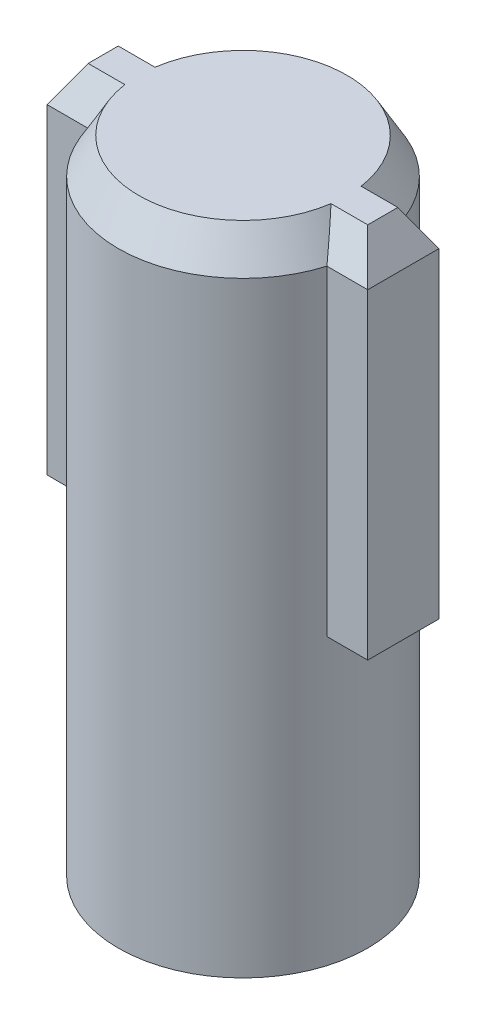
ISO-10303-21;
HEADER;
FILE_DESCRIPTION(('STEP AP214'),'2;1');
FILE_NAME('part.step','',(''),(''),'','','');
FILE_SCHEMA(('AUTOMOTIVE_DESIGN { 1 0 10303 214 1 1 1 1 }'));
ENDSEC;
DATA;
#1=APPLICATION_CONTEXT('core data for automotive mechanical design processes');
#2=APPLICATION_PROTOCOL_DEFINITION('international standard','automotive_design',2000,#1);
#3=PRODUCT_CONTEXT('',#1,'mechanical');
#4=PRODUCT('Part','Part','',(#3));
#5=PRODUCT_RELATED_PRODUCT_CATEGORY('part','',(#4));
#6=PRODUCT_DEFINITION_FORMATION('','',#4);
#7=PRODUCT_DEFINITION_CONTEXT('part definition',#1,'design');
#8=PRODUCT_DEFINITION('design','',#6,#7);
#9=PRODUCT_DEFINITION_SHAPE('','',#8);
#10=(LENGTH_UNIT() NAMED_UNIT(*) SI_UNIT(.MILLI.,.METRE.));
#11=(NAMED_UNIT(*) PLANE_ANGLE_UNIT() SI_UNIT($,.RADIAN.));
#12=(NAMED_UNIT(*) SI_UNIT($,.STERADIAN.) SOLID_ANGLE_UNIT());
#13=UNCERTAINTY_MEASURE_WITH_UNIT(LENGTH_MEASURE(1.E-05),#10,'distance_accuracy_value','');
#14=(GEOMETRIC_REPRESENTATION_CONTEXT(3) GLOBAL_UNCERTAINTY_ASSIGNED_CONTEXT((#13)) GLOBAL_UNIT_ASSIGNED_CONTEXT((#10,
#11,#12)) REPRESENTATION_CONTEXT('',''));
#15=CARTESIAN_POINT('',(0.,0.,0.));
#16=DIRECTION('',(0.,0.,1.));
#17=DIRECTION('',(1.,0.,0.));
#18=AXIS2_PLACEMENT_3D('',#15,#16,#17);
#19=CARTESIAN_POINT('',(0.,18.,0.));
#20=DIRECTION('',(0.,-1.,0.));
#21=DIRECTION('',(0.,0.,-1.));
#22=AXIS2_PLACEMENT_3D('',#19,#20,#21);
#23=CYLINDRICAL_SURFACE('',#22,3.5);
#24=DIRECTION('',(0.,-1.,0.));
#25=VECTOR('',#24,1.);
#26=CARTESIAN_POINT('',(-3.35410196624968,18.,-1.));
#27=LINE('',#26,#25);
#28=CARTESIAN_POINT('',(-3.35410196624968,12.,-1.));
#29=VERTEX_POINT('',#28);
#30=CARTESIAN_POINT('',(-3.35410196624968,17.,-1.));
#31=VERTEX_POINT('',#30);
#32=EDGE_CURVE('E187',#29,#31,#27,.F.);
#33=ORIENTED_EDGE('',*,*,#32,.T.);
#34=CARTESIAN_POINT('',(0.,17.,0.));
#35=DIRECTION('',(0.,1.,0.));
#36=DIRECTION('',(0.,0.,1.));
#37=AXIS2_PLACEMENT_3D('',#34,#35,#36);
#38=CIRCLE('',#37,3.5);
#39=CARTESIAN_POINT('',(3.35410196624968,17.,-1.));
#40=VERTEX_POINT('',#39);
#41=EDGE_CURVE('E220',#31,#40,#38,.F.);
#42=ORIENTED_EDGE('',*,*,#41,.T.);
#43=DIRECTION('',(0.,-1.,0.));
#44=VECTOR('',#43,1.);
#45=CARTESIAN_POINT('',(3.35410196624968,18.,-1.));
#46=LINE('',#45,#44);
#47=CARTESIAN_POINT('',(3.35410196624968,12.,-0.999999999999999));
#48=VERTEX_POINT('',#47);
#49=EDGE_CURVE('E190',#40,#48,#46,.T.);
#50=ORIENTED_EDGE('',*,*,#49,.T.);
#51=CARTESIAN_POINT('',(0.,12.,0.));
#52=DIRECTION('',(0.,-1.,0.));
#53=DIRECTION('',(0.,0.,-1.));
#54=AXIS2_PLACEMENT_3D('',#51,#52,#53);
#55=CIRCLE('',#54,3.5);
#56=EDGE_CURVE('E147',#29,#48,#55,.T.);
#57=ORIENTED_EDGE('',*,*,#56,.F.);
#58=EDGE_LOOP('',(#33,#42,#50,#57));
#59=FACE_BOUND('',#58,.T.);
#60=ADVANCED_FACE('F35',(#59),#23,.T.);
#61=DIRECTION('',(0.,-1.,0.));
#62=VECTOR('',#61,1.);
#63=CARTESIAN_POINT('',(3.35410196624968,18.,1.));
#64=LINE('',#63,#62);
#65=CARTESIAN_POINT('',(3.35410196624968,8.,1.));
#66=VERTEX_POINT('',#65);
#67=CARTESIAN_POINT('',(3.35410196624968,17.,1.));
#68=VERTEX_POINT('',#67);
#69=EDGE_CURVE('E181',#66,#68,#64,.F.);
#70=ORIENTED_EDGE('',*,*,#69,.T.);
#71=CARTESIAN_POINT('',(0.,17.,0.));
#72=DIRECTION('',(0.,1.,0.));
#73=DIRECTION('',(0.,0.,1.));
#74=AXIS2_PLACEMENT_3D('',#71,#72,#73);
#75=CIRCLE('',#74,3.5);
#76=CARTESIAN_POINT('',(-3.35410196624968,17.,1.));
#77=VERTEX_POINT('',#76);
#78=EDGE_CURVE('E11',#68,#77,#75,.F.);
#79=ORIENTED_EDGE('',*,*,#78,.T.);
#80=DIRECTION('',(0.,-1.,0.));
#81=VECTOR('',#80,1.);
#82=CARTESIAN_POINT('',(-3.35410196624968,18.,1.));
#83=LINE('',#82,#81);
#84=CARTESIAN_POINT('',(-3.35410196624968,8.,1.));
#85=VERTEX_POINT('',#84);
#86=EDGE_CURVE('E185',#77,#85,#83,.T.);
#87=ORIENTED_EDGE('',*,*,#86,.T.);
#88=CARTESIAN_POINT('',(0.,8.,0.));
#89=DIRECTION('',(0.,-1.,0.));
#90=DIRECTION('',(0.,0.,-1.));
#91=AXIS2_PLACEMENT_3D('',#88,#89,#90);
#92=CIRCLE('',#91,3.5);
#93=CARTESIAN_POINT('',(-3.35410196624968,8.,-1.));
#94=VERTEX_POINT('',#93);
#95=EDGE_CURVE('E144',#85,#94,#92,.T.);
#96=ORIENTED_EDGE('',*,*,#95,.T.);
#97=CARTESIAN_POINT('',(0.,8.,0.));
#98=DIRECTION('',(0.,-1.,0.));
#99=DIRECTION('',(0.,0.,-1.));
#100=AXIS2_PLACEMENT_3D('',#97,#98,#99);
#101=CIRCLE('',#100,3.5);
#102=CARTESIAN_POINT('',(3.35410196624968,8.,-0.999999999999999));
#103=VERTEX_POINT('',#102);
#104=EDGE_CURVE('E137',#94,#103,#101,.T.);
#105=ORIENTED_EDGE('',*,*,#104,.T.);
#106=EDGE_CURVE('E142',#103,#66,#92,.T.);
#107=ORIENTED_EDGE('',*,*,#106,.T.);
#108=EDGE_LOOP('',(#70,#79,#87,#96,#105,#107));
#109=FACE_BOUND('',#108,.T.);
#110=CARTESIAN_POINT('',(0.,0.,0.));
#111=DIRECTION('',(0.,1.,0.));
#112=DIRECTION('',(0.,0.,1.));
#113=AXIS2_PLACEMENT_3D('',#110,#111,#112);
#114=CIRCLE('',#113,3.5);
#115=CARTESIAN_POINT('',(0.,0.,3.5));
#116=VERTEX_POINT('',#115);
#117=EDGE_CURVE('E192',#116,#116,#114,.T.);
#118=ORIENTED_EDGE('',*,*,#117,.T.);
#119=EDGE_LOOP('',(#118));
#120=FACE_BOUND('',#119,.T.);
#121=ADVANCED_FACE('F139',(#109,#120),#23,.T.);
#122=CARTESIAN_POINT('',(0.,18.,0.));
#123=DIRECTION('',(0.,1.,0.));
#124=DIRECTION('',(0.,0.,1.));
#125=AXIS2_PLACEMENT_3D('',#122,#123,#124);
#126=PLANE('',#125);
#127=DIRECTION('',(0.,0.,1.));
#128=VECTOR('',#127,1.);
#129=CARTESIAN_POINT('',(-3.92264973081037,18.,0.));
#130=LINE('',#129,#128);
#131=CARTESIAN_POINT('',(-3.92264973081037,18.,-0.422649730810368));
#132=VERTEX_POINT('',#131);
#133=CARTESIAN_POINT('',(-3.92264973081037,18.,0.422649730810368));
#134=VERTEX_POINT('',#133);
#135=EDGE_CURVE('E206',#132,#134,#130,.T.);
#136=ORIENTED_EDGE('',*,*,#135,.T.);
#137=DIRECTION('',(1.,0.,0.));
#138=VECTOR('',#137,1.);
#139=CARTESIAN_POINT('',(0.,18.,0.422649730810368));
#140=LINE('',#139,#138);
#141=CARTESIAN_POINT('',(-2.891928189643,18.,0.422649730810362));
#142=VERTEX_POINT('',#141);
#143=EDGE_CURVE('E208',#134,#142,#140,.T.);
#144=ORIENTED_EDGE('',*,*,#143,.T.);
#145=CARTESIAN_POINT('',(0.,18.,0.));
#146=DIRECTION('',(0.,1.,0.));
#147=DIRECTION('',(0.,0.,1.));
#148=AXIS2_PLACEMENT_3D('',#145,#146,#147);
#149=CIRCLE('',#148,2.92264973081037);
#150=CARTESIAN_POINT('',(2.891928189643,18.,0.422649730810361));
#151=VERTEX_POINT('',#150);
#152=EDGE_CURVE('E163',#142,#151,#149,.T.);
#153=ORIENTED_EDGE('',*,*,#152,.T.);
#154=DIRECTION('',(1.,0.,0.));
#155=VECTOR('',#154,1.);
#156=CARTESIAN_POINT('',(0.,18.,0.422649730810368));
#157=LINE('',#156,#155);
#158=CARTESIAN_POINT('',(3.92264973081037,18.,0.422649730810367));
#159=VERTEX_POINT('',#158);
#160=EDGE_CURVE('E196',#151,#159,#157,.T.);
#161=ORIENTED_EDGE('',*,*,#160,.T.);
#162=DIRECTION('',(0.,0.,-1.));
#163=VECTOR('',#162,1.);
#164=CARTESIAN_POINT('',(3.92264973081037,18.,0.));
#165=LINE('',#164,#163);
#166=CARTESIAN_POINT('',(3.92264973081037,18.,-0.422649730810369));
#167=VERTEX_POINT('',#166);
#168=EDGE_CURVE('E198',#159,#167,#165,.T.);
#169=ORIENTED_EDGE('',*,*,#168,.T.);
#170=DIRECTION('',(-1.,0.,0.));
#171=VECTOR('',#170,1.);
#172=CARTESIAN_POINT('',(0.,18.,-0.422649730810368));
#173=LINE('',#172,#171);
#174=CARTESIAN_POINT('',(2.891928189643,18.,-0.422649730810369));
#175=VERTEX_POINT('',#174);
#176=EDGE_CURVE('E200',#167,#175,#173,.T.);
#177=ORIENTED_EDGE('',*,*,#176,.T.);
#178=CARTESIAN_POINT('',(0.,18.,0.));
#179=DIRECTION('',(0.,1.,0.));
#180=DIRECTION('',(0.,0.,1.));
#181=AXIS2_PLACEMENT_3D('',#178,#179,#180);
#182=CIRCLE('',#181,2.92264973081037);
#183=CARTESIAN_POINT('',(-2.891928189643,18.,-0.422649730810361));
#184=VERTEX_POINT('',#183);
#185=EDGE_CURVE('E202',#175,#184,#182,.T.);
#186=ORIENTED_EDGE('',*,*,#185,.T.);
#187=DIRECTION('',(-1.,0.,0.));
#188=VECTOR('',#187,1.);
#189=CARTESIAN_POINT('',(0.,18.,-0.422649730810368));
#190=LINE('',#189,#188);
#191=EDGE_CURVE('E204',#184,#132,#190,.T.);
#192=ORIENTED_EDGE('',*,*,#191,.T.);
#193=EDGE_LOOP('',(#136,#144,#153,#161,#169,#177,#186,#192));
#194=FACE_BOUND('',#193,.T.);
#195=ADVANCED_FACE('F285',(#194),#126,.T.);
#196=CARTESIAN_POINT('',(0.,0.,0.));
#197=DIRECTION('',(0.,1.,0.));
#198=DIRECTION('',(0.,0.,1.));
#199=AXIS2_PLACEMENT_3D('',#196,#197,#198);
#200=PLANE('',#199);
#201=ORIENTED_EDGE('',*,*,#117,.F.);
#202=EDGE_LOOP('',(#201));
#203=FACE_BOUND('',#202,.T.);
#204=ADVANCED_FACE('F287',(#203),#200,.F.);
#205=CARTESIAN_POINT('',(-4.5,8.,-1.));
#206=DIRECTION('',(-1.,0.,0.));
#207=DIRECTION('',(0.,0.,1.));
#208=AXIS2_PLACEMENT_3D('',#205,#206,#207);
#209=PLANE('',#208);
#210=DIRECTION('',(0.,1.,0.));
#211=VECTOR('',#210,1.);
#212=CARTESIAN_POINT('',(-4.5,8.,1.));
#213=LINE('',#212,#211);
#214=CARTESIAN_POINT('',(-4.5,8.,1.));
#215=VERTEX_POINT('',#214);
#216=CARTESIAN_POINT('',(-4.5,17.,1.));
#217=VERTEX_POINT('',#216);
#218=EDGE_CURVE('E169',#215,#217,#213,.T.);
#219=ORIENTED_EDGE('',*,*,#218,.T.);
#220=DIRECTION('',(0.,0.,-1.));
#221=VECTOR('',#220,1.);
#222=CARTESIAN_POINT('',(-4.5,17.,-1.));
#223=LINE('',#222,#221);
#224=CARTESIAN_POINT('',(-4.5,17.,-1.));
#225=VERTEX_POINT('',#224);
#226=EDGE_CURVE('E214',#217,#225,#223,.T.);
#227=ORIENTED_EDGE('',*,*,#226,.T.);
#228=DIRECTION('',(0.,1.,0.));
#229=VECTOR('',#228,1.);
#230=CARTESIAN_POINT('',(-4.5,8.,-1.));
#231=LINE('',#230,#229);
#232=CARTESIAN_POINT('',(-4.5,8.,-1.));
#233=VERTEX_POINT('',#232);
#234=EDGE_CURVE('E179',#233,#225,#231,.T.);
#235=ORIENTED_EDGE('',*,*,#234,.F.);
#236=DIRECTION('',(0.,0.,1.));
#237=VECTOR('',#236,1.);
#238=CARTESIAN_POINT('',(-4.5,8.,-1.));
#239=LINE('',#238,#237);
#240=EDGE_CURVE('E323',#233,#215,#239,.T.);
#241=ORIENTED_EDGE('',*,*,#240,.T.);
#242=EDGE_LOOP('',(#219,#227,#235,#241));
#243=FACE_BOUND('',#242,.T.);
#244=ADVANCED_FACE('F290',(#243),#209,.T.);
#245=CARTESIAN_POINT('',(0.,8.,0.));
#246=DIRECTION('',(0.,-1.,0.));
#247=DIRECTION('',(0.,0.,-1.));
#248=AXIS2_PLACEMENT_3D('',#245,#246,#247);
#249=PLANE('',#248);
#250=ORIENTED_EDGE('',*,*,#95,.F.);
#251=DIRECTION('',(1.,0.,0.));
#252=VECTOR('',#251,1.);
#253=CARTESIAN_POINT('',(4.5,8.,0.999999999999999));
#254=LINE('',#253,#252);
#255=EDGE_CURVE('E330',#215,#85,#254,.T.);
#256=ORIENTED_EDGE('',*,*,#255,.F.);
#257=ORIENTED_EDGE('',*,*,#240,.F.);
#258=DIRECTION('',(-1.,0.,0.));
#259=VECTOR('',#258,1.);
#260=CARTESIAN_POINT('',(4.5,8.,-1.));
#261=LINE('',#260,#259);
#262=EDGE_CURVE('E170',#94,#233,#261,.T.);
#263=ORIENTED_EDGE('',*,*,#262,.F.);
#264=EDGE_LOOP('',(#250,#256,#257,#263));
#265=FACE_BOUND('',#264,.T.);
#266=ADVANCED_FACE('F297',(#265),#249,.T.);
#267=CARTESIAN_POINT('',(4.5,8.,0.999999999999999));
#268=DIRECTION('',(0.,0.,1.));
#269=DIRECTION('',(1.,0.,0.));
#270=AXIS2_PLACEMENT_3D('',#267,#268,#269);
#271=PLANE('',#270);
#272=ORIENTED_EDGE('',*,*,#86,.F.);
#273=DIRECTION('',(-1.,0.,0.));
#274=VECTOR('',#273,1.);
#275=CARTESIAN_POINT('',(4.5,17.,0.999999999999999));
#276=LINE('',#275,#274);
#277=EDGE_CURVE('E211',#77,#217,#276,.T.);
#278=ORIENTED_EDGE('',*,*,#277,.T.);
#279=ORIENTED_EDGE('',*,*,#218,.F.);
#280=ORIENTED_EDGE('',*,*,#255,.T.);
#281=EDGE_LOOP('',(#272,#278,#279,#280));
#282=FACE_BOUND('',#281,.T.);
#283=ADVANCED_FACE('F299',(#282),#271,.T.);
#284=ORIENTED_EDGE('',*,*,#106,.F.);
#285=CARTESIAN_POINT('',(4.5,8.,-1.));
#286=VERTEX_POINT('',#285);
#287=EDGE_CURVE('E161',#286,#103,#261,.T.);
#288=ORIENTED_EDGE('',*,*,#287,.F.);
#289=DIRECTION('',(0.,0.,-1.));
#290=VECTOR('',#289,1.);
#291=CARTESIAN_POINT('',(4.5,8.,-1.));
#292=LINE('',#291,#290);
#293=CARTESIAN_POINT('',(4.5,8.,0.999999999999999));
#294=VERTEX_POINT('',#293);
#295=EDGE_CURVE('E175',#294,#286,#292,.T.);
#296=ORIENTED_EDGE('',*,*,#295,.F.);
#297=EDGE_CURVE('E162',#66,#294,#254,.T.);
#298=ORIENTED_EDGE('',*,*,#297,.F.);
#299=EDGE_LOOP('',(#284,#288,#296,#298));
#300=FACE_BOUND('',#299,.T.);
#301=ADVANCED_FACE('F159',(#300),#249,.T.);
#302=CARTESIAN_POINT('',(4.5,8.,-1.));
#303=DIRECTION('',(0.,0.,-1.));
#304=DIRECTION('',(-1.,0.,0.));
#305=AXIS2_PLACEMENT_3D('',#302,#303,#304);
#306=PLANE('',#305);
#307=ORIENTED_EDGE('',*,*,#234,.T.);
#308=DIRECTION('',(1.,0.,0.));
#309=VECTOR('',#308,1.);
#310=CARTESIAN_POINT('',(4.5,17.,-1.));
#311=LINE('',#310,#309);
#312=EDGE_CURVE('E218',#225,#31,#311,.T.);
#313=ORIENTED_EDGE('',*,*,#312,.T.);
#314=ORIENTED_EDGE('',*,*,#32,.F.);
#315=DIRECTION('',(-1.,0.,0.));
#316=VECTOR('',#315,1.);
#317=CARTESIAN_POINT('',(-5.,12.,-1.));
#318=LINE('',#317,#316);
#319=EDGE_CURVE('E148',#48,#29,#318,.T.);
#320=ORIENTED_EDGE('',*,*,#319,.F.);
#321=ORIENTED_EDGE('',*,*,#49,.F.);
#322=DIRECTION('',(1.,0.,0.));
#323=VECTOR('',#322,1.);
#324=CARTESIAN_POINT('',(4.5,17.,-1.));
#325=LINE('',#324,#323);
#326=CARTESIAN_POINT('',(4.5,17.,-1.));
#327=VERTEX_POINT('',#326);
#328=EDGE_CURVE('E216',#40,#327,#325,.T.);
#329=ORIENTED_EDGE('',*,*,#328,.T.);
#330=DIRECTION('',(0.,1.,0.));
#331=VECTOR('',#330,1.);
#332=CARTESIAN_POINT('',(4.5,8.,-1.));
#333=LINE('',#332,#331);
#334=EDGE_CURVE('E167',#286,#327,#333,.T.);
#335=ORIENTED_EDGE('',*,*,#334,.F.);
#336=ORIENTED_EDGE('',*,*,#287,.T.);
#337=DIRECTION('',(-1.,0.,0.));
#338=VECTOR('',#337,1.);
#339=CARTESIAN_POINT('',(-5.,8.,-1.));
#340=LINE('',#339,#338);
#341=EDGE_CURVE('E150',#103,#94,#340,.T.);
#342=ORIENTED_EDGE('',*,*,#341,.T.);
#343=ORIENTED_EDGE('',*,*,#262,.T.);
#344=EDGE_LOOP('',(#307,#313,#314,#320,#321,#329,#335,#336,#342,#343));
#345=FACE_BOUND('',#344,.T.);
#346=ADVANCED_FACE('F166',(#345),#306,.T.);
#347=DIRECTION('',(0.,1.,0.));
#348=VECTOR('',#347,1.);
#349=CARTESIAN_POINT('',(4.5,8.,0.999999999999999));
#350=LINE('',#349,#348);
#351=CARTESIAN_POINT('',(4.5,17.,0.999999999999999));
#352=VERTEX_POINT('',#351);
#353=EDGE_CURVE('E173',#294,#352,#350,.T.);
#354=ORIENTED_EDGE('',*,*,#353,.T.);
#355=DIRECTION('',(-1.,0.,0.));
#356=VECTOR('',#355,1.);
#357=CARTESIAN_POINT('',(4.5,17.,0.999999999999999));
#358=LINE('',#357,#356);
#359=EDGE_CURVE('E49',#352,#68,#358,.T.);
#360=ORIENTED_EDGE('',*,*,#359,.T.);
#361=ORIENTED_EDGE('',*,*,#69,.F.);
#362=ORIENTED_EDGE('',*,*,#297,.T.);
#363=EDGE_LOOP('',(#354,#360,#361,#362));
#364=FACE_BOUND('',#363,.T.);
#365=ADVANCED_FACE('F303',(#364),#271,.T.);
#366=CARTESIAN_POINT('',(4.5,8.,-1.));
#367=DIRECTION('',(1.,0.,0.));
#368=DIRECTION('',(0.,0.,-1.));
#369=AXIS2_PLACEMENT_3D('',#366,#367,#368);
#370=PLANE('',#369);
#371=ORIENTED_EDGE('',*,*,#334,.T.);
#372=DIRECTION('',(0.,0.,1.));
#373=VECTOR('',#372,1.);
#374=CARTESIAN_POINT('',(4.5,17.,-1.));
#375=LINE('',#374,#373);
#376=EDGE_CURVE('E64',#327,#352,#375,.T.);
#377=ORIENTED_EDGE('',*,*,#376,.T.);
#378=ORIENTED_EDGE('',*,*,#353,.F.);
#379=ORIENTED_EDGE('',*,*,#295,.T.);
#380=EDGE_LOOP('',(#371,#377,#378,#379));
#381=FACE_BOUND('',#380,.T.);
#382=ADVANCED_FACE('F304',(#381),#370,.T.);
#383=CARTESIAN_POINT('',(0.,12.,0.));
#384=DIRECTION('',(0.,-1.,0.));
#385=DIRECTION('',(0.,0.,-1.));
#386=AXIS2_PLACEMENT_3D('',#383,#384,#385);
#387=PLANE('',#386);
#388=ORIENTED_EDGE('',*,*,#56,.T.);
#389=ORIENTED_EDGE('',*,*,#319,.T.);
#390=EDGE_LOOP('',(#388,#389));
#391=FACE_BOUND('',#390,.T.);
#392=ADVANCED_FACE('F307',(#391),#387,.T.);
#393=CARTESIAN_POINT('',(0.,8.,0.));
#394=DIRECTION('',(0.,-1.,0.));
#395=DIRECTION('',(0.,0.,-1.));
#396=AXIS2_PLACEMENT_3D('',#393,#394,#395);
#397=PLANE('',#396);
#398=ORIENTED_EDGE('',*,*,#104,.F.);
#399=ORIENTED_EDGE('',*,*,#341,.F.);
#400=EDGE_LOOP('',(#398,#399));
#401=FACE_BOUND('',#400,.T.);
#402=ADVANCED_FACE('F151',(#401),#397,.F.);
#403=CARTESIAN_POINT('',(0.,18.,-0.422649730810368));
#404=DIRECTION('',(0.,-0.499999999999998,0.86602540378444));
#405=DIRECTION('',(-1.,0.,0.));
#406=AXIS2_PLACEMENT_3D('',#403,#404,#405);
#407=PLANE('',#406);
#408=DIRECTION('',(-0.447213595499956,0.774596669241485,0.447213595499957));
#409=VECTOR('',#408,1.);
#410=CARTESIAN_POINT('',(3.83811978464829,18.1464101615138,-0.338119784648296));
#411=LINE('',#410,#409);
#412=EDGE_CURVE('E264',#327,#167,#411,.T.);
#413=ORIENTED_EDGE('',*,*,#412,.F.);
#414=ORIENTED_EDGE('',*,*,#328,.F.);
#415=CARTESIAN_POINT('',(3.35410196624968,17.,-1.));
#416=CARTESIAN_POINT('',(3.31789876279821,17.0841225359634,-0.951431831216601));
#417=CARTESIAN_POINT('',(3.28118510315563,17.1680814693473,-0.902958118426541));
#418=CARTESIAN_POINT('',(3.20664393840968,17.3356117830366,-0.806234446720612));
#419=CARTESIAN_POINT('',(3.16881661552825,17.4191832241831,-0.757984452678081));
#420=CARTESIAN_POINT('',(3.09194204926259,17.5859087019816,-0.661725453190358));
#421=CARTESIAN_POINT('',(3.05289476073218,17.669062723054,-0.613716456740038));
#422=CARTESIAN_POINT('',(2.97345206026992,17.8349019365773,-0.517969142170157));
#423=CARTESIAN_POINT('',(2.93305642980277,17.9175870504635,-0.470230869409975));
#424=CARTESIAN_POINT('',(2.891928189643,18.,-0.422649730810368));
#425=B_SPLINE_CURVE_WITH_KNOTS('',3,(#415,#416,#417,#418,#419,#420,#421,#422,#423,#424),
.UNSPECIFIED.,.F.,.F.,(4,2,2,2,4),(0.,0.310991130380704,0.621931654926695,0.932883699835558,
1.24388639002683),.UNSPECIFIED.);
#426=EDGE_CURVE('E40',#175,#40,#425,.F.);
#427=ORIENTED_EDGE('',*,*,#426,.F.);
#428=ORIENTED_EDGE('',*,*,#176,.F.);
#429=EDGE_LOOP('',(#413,#414,#427,#428));
#430=FACE_BOUND('',#429,.T.);
#431=ADVANCED_FACE('F37',(#430),#407,.F.);
#432=CARTESIAN_POINT('',(0.,18.,0.));
#433=DIRECTION('',(0.,-1.,0.));
#434=DIRECTION('',(0.,0.,-1.));
#435=AXIS2_PLACEMENT_3D('',#432,#433,#434);
#436=CONICAL_SURFACE('',#435,2.92264973081037,0.523598775598297);
#437=ORIENTED_EDGE('',*,*,#426,.T.);
#438=ORIENTED_EDGE('',*,*,#41,.F.);
#439=CARTESIAN_POINT('',(-3.35410196624968,17.,-1.));
#440=CARTESIAN_POINT('',(-3.31789876279821,17.0841225359634,-0.951431831216601));
#441=CARTESIAN_POINT('',(-3.28118510315563,17.1680814693473,-0.902958118426541));
#442=CARTESIAN_POINT('',(-3.20664393840968,17.3356117830366,-0.806234446720613));
#443=CARTESIAN_POINT('',(-3.16881661552825,17.4191832241831,-0.757984452678084));
#444=CARTESIAN_POINT('',(-3.0919420492626,17.5859087019816,-0.661725453190362));
#445=CARTESIAN_POINT('',(-3.05289476073218,17.669062723054,-0.613716456740043));
#446=CARTESIAN_POINT('',(-2.97345206026993,17.8349019365773,-0.517969142170163));
#447=CARTESIAN_POINT('',(-2.93305642980278,17.9175870504635,-0.470230869409981));
#448=CARTESIAN_POINT('',(-2.89192818964301,18.,-0.422649730810376));
#449=B_SPLINE_CURVE_WITH_KNOTS('',3,(#439,#440,#441,#442,#443,#444,#445,#446,#447,#448),
.UNSPECIFIED.,.F.,.F.,(4,2,2,2,4),(0.,0.310991130380704,0.621931654926687,0.932883699835545,
1.24388639002681),.UNSPECIFIED.);
#450=EDGE_CURVE('E258',#184,#31,#449,.F.);
#451=ORIENTED_EDGE('',*,*,#450,.F.);
#452=ORIENTED_EDGE('',*,*,#185,.F.);
#453=EDGE_LOOP('',(#437,#438,#451,#452));
#454=FACE_BOUND('',#453,.T.);
#455=ADVANCED_FACE('F267',(#454),#436,.T.);
#456=CARTESIAN_POINT('',(3.92264973081037,18.,0.));
#457=DIRECTION('',(-0.86602540378444,-0.499999999999998,0.));
#458=DIRECTION('',(0.,0.,-1.));
#459=AXIS2_PLACEMENT_3D('',#456,#457,#458);
#460=PLANE('',#459);
#461=ORIENTED_EDGE('',*,*,#412,.T.);
#462=ORIENTED_EDGE('',*,*,#168,.F.);
#463=DIRECTION('',(-0.447213595499956,0.774596669241485,-0.447213595499957));
#464=VECTOR('',#463,1.);
#465=CARTESIAN_POINT('',(3.1381197846483,19.358845726812,-0.361880215351702));
#466=LINE('',#465,#464);
#467=EDGE_CURVE('E255',#352,#159,#466,.T.);
#468=ORIENTED_EDGE('',*,*,#467,.F.);
#469=ORIENTED_EDGE('',*,*,#376,.F.);
#470=EDGE_LOOP('',(#461,#462,#468,#469));
#471=FACE_BOUND('',#470,.T.);
#472=ADVANCED_FACE('F270',(#471),#460,.F.);
#473=CARTESIAN_POINT('',(0.,18.,-0.422649730810368));
#474=DIRECTION('',(0.,-0.499999999999999,0.86602540378444));
#475=DIRECTION('',(-1.,0.,0.));
#476=AXIS2_PLACEMENT_3D('',#473,#474,#475);
#477=PLANE('',#476);
#478=ORIENTED_EDGE('',*,*,#450,.T.);
#479=ORIENTED_EDGE('',*,*,#312,.F.);
#480=DIRECTION('',(0.447213595499956,0.774596669241485,0.447213595499957));
#481=VECTOR('',#480,1.);
#482=CARTESIAN_POINT('',(-3.1381197846483,19.358845726812,0.361880215351701));
#483=LINE('',#482,#481);
#484=EDGE_CURVE('E252',#132,#225,#483,.F.);
#485=ORIENTED_EDGE('',*,*,#484,.F.);
#486=ORIENTED_EDGE('',*,*,#191,.F.);
#487=EDGE_LOOP('',(#478,#479,#485,#486));
#488=FACE_BOUND('',#487,.T.);
#489=ADVANCED_FACE('F265',(#488),#477,.F.);
#490=CARTESIAN_POINT('',(0.,18.,0.422649730810368));
#491=DIRECTION('',(0.,-0.499999999999999,-0.86602540378444));
#492=DIRECTION('',(1.,0.,0.));
#493=AXIS2_PLACEMENT_3D('',#490,#491,#492);
#494=PLANE('',#493);
#495=ORIENTED_EDGE('',*,*,#467,.T.);
#496=ORIENTED_EDGE('',*,*,#160,.F.);
#497=CARTESIAN_POINT('',(3.35410196624968,17.,1.));
#498=CARTESIAN_POINT('',(3.31789876279821,17.0841225359634,0.9514318312166));
#499=CARTESIAN_POINT('',(3.28118510315563,17.1680814693473,0.90295811842654));
#500=CARTESIAN_POINT('',(3.20664393840968,17.3356117830366,0.806234446720612));
#501=CARTESIAN_POINT('',(3.16881661552825,17.4191832241831,0.757984452678083));
#502=CARTESIAN_POINT('',(3.0919420492626,17.5859087019816,0.661725453190361));
#503=CARTESIAN_POINT('',(3.05289476073218,17.669062723054,0.613716456740042));
#504=CARTESIAN_POINT('',(2.97345206026993,17.8349019365773,0.517969142170163));
#505=CARTESIAN_POINT('',(2.93305642980278,17.9175870504635,0.470230869409981));
#506=CARTESIAN_POINT('',(2.89192818964301,18.,0.422649730810375));
#507=B_SPLINE_CURVE_WITH_KNOTS('',3,(#497,#498,#499,#500,#501,#502,#503,#504,#505,#506),
.UNSPECIFIED.,.F.,.F.,(4,2,2,2,4),(0.,0.310991130380704,0.621931654926687,0.932883699835545,
1.24388639002681),.UNSPECIFIED.);
#508=EDGE_CURVE('E246',#68,#151,#507,.T.);
#509=ORIENTED_EDGE('',*,*,#508,.F.);
#510=ORIENTED_EDGE('',*,*,#359,.F.);
#511=EDGE_LOOP('',(#495,#496,#509,#510));
#512=FACE_BOUND('',#511,.T.);
#513=ADVANCED_FACE('F242',(#512),#494,.F.);
#514=CARTESIAN_POINT('',(-3.92264973081037,18.,0.));
#515=DIRECTION('',(0.86602540378444,-0.499999999999998,0.));
#516=DIRECTION('',(0.,0.,1.));
#517=AXIS2_PLACEMENT_3D('',#514,#515,#516);
#518=PLANE('',#517);
#519=ORIENTED_EDGE('',*,*,#484,.T.);
#520=ORIENTED_EDGE('',*,*,#226,.F.);
#521=DIRECTION('',(0.447213595499956,0.774596669241485,-0.447213595499957));
#522=VECTOR('',#521,1.);
#523=CARTESIAN_POINT('',(-3.8381197846483,18.1464101615138,0.338119784648296));
#524=LINE('',#523,#522);
#525=EDGE_CURVE('E231',#134,#217,#524,.F.);
#526=ORIENTED_EDGE('',*,*,#525,.F.);
#527=ORIENTED_EDGE('',*,*,#135,.F.);
#528=EDGE_LOOP('',(#519,#520,#526,#527));
#529=FACE_BOUND('',#528,.T.);
#530=ADVANCED_FACE('F240',(#529),#518,.F.);
#531=CARTESIAN_POINT('',(0.,18.,0.));
#532=DIRECTION('',(0.,-1.,0.));
#533=DIRECTION('',(0.,0.,-1.));
#534=AXIS2_PLACEMENT_3D('',#531,#532,#533);
#535=CONICAL_SURFACE('',#534,2.92264973081037,0.523598775598297);
#536=ORIENTED_EDGE('',*,*,#508,.T.);
#537=ORIENTED_EDGE('',*,*,#152,.F.);
#538=CARTESIAN_POINT('',(-2.89192818964305,18.,0.422649730810368));
#539=CARTESIAN_POINT('',(-2.93305642980279,17.9175870504635,0.470230869409978));
#540=CARTESIAN_POINT('',(-2.97345206026993,17.8349019365773,0.517969142170162));
#541=CARTESIAN_POINT('',(-3.05289476073218,17.669062723054,0.613716456740043));
#542=CARTESIAN_POINT('',(-3.0919420492626,17.5859087019816,0.661725453190362));
#543=CARTESIAN_POINT('',(-3.16881661552825,17.4191832241831,0.757984452678084));
#544=CARTESIAN_POINT('',(-3.20664393840968,17.3356117830366,0.806234446720614));
#545=CARTESIAN_POINT('',(-3.28118510315563,17.1680814693473,0.902958118426542));
#546=CARTESIAN_POINT('',(-3.31789876279821,17.0841225359634,0.951431831216602));
#547=CARTESIAN_POINT('',(-3.35410196624968,17.,1.));
#548=B_SPLINE_CURVE_WITH_KNOTS('',3,(#538,#539,#540,#541,#542,#543,#544,#545,#546,#547),
.UNSPECIFIED.,.F.,.F.,(4,2,2,2,4),(0.,0.311002690191268,0.621954735100127,0.932895259646115,
1.24388639002681),.UNSPECIFIED.);
#549=EDGE_CURVE('E224',#77,#142,#548,.F.);
#550=ORIENTED_EDGE('',*,*,#549,.F.);
#551=ORIENTED_EDGE('',*,*,#78,.F.);
#552=EDGE_LOOP('',(#536,#537,#550,#551));
#553=FACE_BOUND('',#552,.T.);
#554=ADVANCED_FACE('F236',(#553),#535,.T.);
#555=CARTESIAN_POINT('',(0.,18.,0.422649730810368));
#556=DIRECTION('',(0.,-0.499999999999998,-0.86602540378444));
#557=DIRECTION('',(1.,0.,0.));
#558=AXIS2_PLACEMENT_3D('',#555,#556,#557);
#559=PLANE('',#558);
#560=ORIENTED_EDGE('',*,*,#525,.T.);
#561=ORIENTED_EDGE('',*,*,#277,.F.);
#562=ORIENTED_EDGE('',*,*,#549,.T.);
#563=ORIENTED_EDGE('',*,*,#143,.F.);
#564=EDGE_LOOP('',(#560,#561,#562,#563));
#565=FACE_BOUND('',#564,.T.);
#566=ADVANCED_FACE('F233',(#565),#559,.F.);
#567=CLOSED_SHELL('',(#60,#121,#195,#204,#244,#266,#283,#301,#346,#365,#382,#392,#402,#431,#455,
#472,#489,#513,#530,#554,#566));
#568=MANIFOLD_SOLID_BREP('B2',#567);
#569=ADVANCED_BREP_SHAPE_REPRESENTATION('',(#18,#568),#14);
#570=SHAPE_DEFINITION_REPRESENTATION(#9,#569);
ENDSEC;
END-ISO-10303-21;
